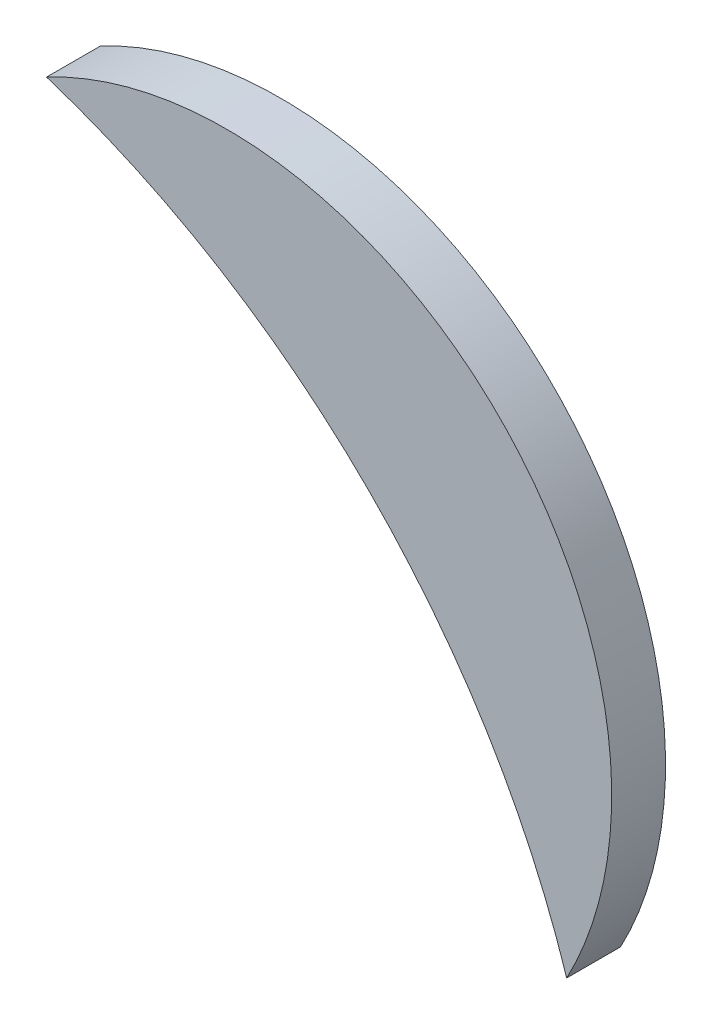
ISO-10303-21;
HEADER;
FILE_DESCRIPTION(('STEP AP214'),'2;1');
FILE_NAME('part.step','',(''),(''),'','','');
FILE_SCHEMA(('AUTOMOTIVE_DESIGN { 1 0 10303 214 1 1 1 1 }'));
ENDSEC;
DATA;
#1=APPLICATION_CONTEXT('core data for automotive mechanical design processes');
#2=APPLICATION_PROTOCOL_DEFINITION('international standard','automotive_design',2000,#1);
#3=PRODUCT_CONTEXT('',#1,'mechanical');
#4=PRODUCT('Part','Part','',(#3));
#5=PRODUCT_RELATED_PRODUCT_CATEGORY('part','',(#4));
#6=PRODUCT_DEFINITION_FORMATION('','',#4);
#7=PRODUCT_DEFINITION_CONTEXT('part definition',#1,'design');
#8=PRODUCT_DEFINITION('design','',#6,#7);
#9=PRODUCT_DEFINITION_SHAPE('','',#8);
#10=(LENGTH_UNIT() NAMED_UNIT(*) SI_UNIT(.MILLI.,.METRE.));
#11=(NAMED_UNIT(*) PLANE_ANGLE_UNIT() SI_UNIT($,.RADIAN.));
#12=(NAMED_UNIT(*) SI_UNIT($,.STERADIAN.) SOLID_ANGLE_UNIT());
#13=UNCERTAINTY_MEASURE_WITH_UNIT(LENGTH_MEASURE(1.E-05),#10,'distance_accuracy_value','');
#14=(GEOMETRIC_REPRESENTATION_CONTEXT(3) GLOBAL_UNCERTAINTY_ASSIGNED_CONTEXT((#13)) GLOBAL_UNIT_ASSIGNED_CONTEXT((#10,
#11,#12)) REPRESENTATION_CONTEXT('',''));
#15=CARTESIAN_POINT('',(0.,0.,0.));
#16=DIRECTION('',(0.,0.,1.));
#17=DIRECTION('',(1.,0.,0.));
#18=AXIS2_PLACEMENT_3D('',#15,#16,#17);
#19=CARTESIAN_POINT('',(139.628776,-111.910776,0.));
#20=DIRECTION('',(0.,0.,1.));
#21=DIRECTION('',(1.,0.,0.));
#22=AXIS2_PLACEMENT_3D('',#19,#20,#21);
#23=PLANE('',#22);
#24=CARTESIAN_POINT('',(139.452,-111.734,0.));
#25=DIRECTION('',(0.,0.,-1.));
#26=DIRECTION('',(0.,-1.,0.));
#27=AXIS2_PLACEMENT_3D('',#24,#25,#26);
#28=CIRCLE('',#27,0.525);
#29=CARTESIAN_POINT('',(139.61346385155,-111.234445774,0.));
#30=VERTEX_POINT('',#29);
#31=CARTESIAN_POINT('',(139.95155364678,-111.5725343566,0.));
#32=VERTEX_POINT('',#31);
#33=EDGE_CURVE('E11',#30,#32,#28,.T.);
#34=ORIENTED_EDGE('',*,*,#33,.T.);
#35=CARTESIAN_POINT('',(139.7307995,-111.4551995,0.));
#36=DIRECTION('',(0.,0.,1.));
#37=DIRECTION('',(0.707106781186548,-0.707106781186548,0.));
#38=AXIS2_PLACEMENT_3D('',#35,#36,#37);
#39=CIRCLE('',#38,0.249999723809);
#40=EDGE_CURVE('E57',#32,#30,#39,.T.);
#41=ORIENTED_EDGE('',*,*,#40,.T.);
#42=EDGE_LOOP('',(#34,#41));
#43=FACE_BOUND('',#42,.T.);
#44=ADVANCED_FACE('F17',(#43),#23,.T.);
#45=CARTESIAN_POINT('',(139.452,-111.734,-0.045));
#46=DIRECTION('',(0.,0.,-1.));
#47=DIRECTION('',(0.,-1.,0.));
#48=AXIS2_PLACEMENT_3D('',#45,#46,#47);
#49=CYLINDRICAL_SURFACE('',#48,0.525);
#50=DIRECTION('',(0.,0.,-1.));
#51=VECTOR('',#50,1.);
#52=CARTESIAN_POINT('',(139.95155364678,-111.5725343566,-0.035));
#53=LINE('',#52,#51);
#54=CARTESIAN_POINT('',(139.95155364678,-111.5725343566,-0.035));
#55=VERTEX_POINT('',#54);
#56=EDGE_CURVE('E55',#32,#55,#53,.T.);
#57=ORIENTED_EDGE('',*,*,#56,.F.);
#58=ORIENTED_EDGE('',*,*,#33,.F.);
#59=DIRECTION('',(0.,0.,-1.));
#60=VECTOR('',#59,1.);
#61=CARTESIAN_POINT('',(139.61346385156,-111.234445774,-0.035));
#62=LINE('',#61,#60);
#63=CARTESIAN_POINT('',(139.61346385155,-111.234445774,-0.035));
#64=VERTEX_POINT('',#63);
#65=EDGE_CURVE('E53',#30,#64,#62,.T.);
#66=ORIENTED_EDGE('',*,*,#65,.T.);
#67=CARTESIAN_POINT('',(139.452,-111.734,-0.035));
#68=DIRECTION('',(0.,0.,-1.));
#69=DIRECTION('',(0.,-1.,0.));
#70=AXIS2_PLACEMENT_3D('',#67,#68,#69);
#71=CIRCLE('',#70,0.525);
#72=EDGE_CURVE('E20',#64,#55,#71,.T.);
#73=ORIENTED_EDGE('',*,*,#72,.T.);
#74=EDGE_LOOP('',(#57,#58,#66,#73));
#75=FACE_BOUND('',#74,.T.);
#76=ADVANCED_FACE('F51',(#75),#49,.F.);
#77=CARTESIAN_POINT('',(139.628776,-111.910776,-0.035));
#78=DIRECTION('',(0.,0.,1.));
#79=DIRECTION('',(1.,0.,0.));
#80=AXIS2_PLACEMENT_3D('',#77,#78,#79);
#81=PLANE('',#80);
#82=CARTESIAN_POINT('',(139.7307995,-111.4551995,-0.035));
#83=DIRECTION('',(0.,0.,1.));
#84=DIRECTION('',(0.707106781186548,-0.707106781186548,0.));
#85=AXIS2_PLACEMENT_3D('',#82,#83,#84);
#86=CIRCLE('',#85,0.249999723809);
#87=EDGE_CURVE('E63',#55,#64,#86,.T.);
#88=ORIENTED_EDGE('',*,*,#87,.F.);
#89=ORIENTED_EDGE('',*,*,#72,.F.);
#90=EDGE_LOOP('',(#88,#89));
#91=FACE_BOUND('',#90,.T.);
#92=ADVANCED_FACE('F95',(#91),#81,.F.);
#93=CARTESIAN_POINT('',(139.7307995,-111.4551995,-0.035));
#94=DIRECTION('',(0.,0.,-1.));
#95=DIRECTION('',(0.707106781186548,-0.707106781186548,0.));
#96=AXIS2_PLACEMENT_3D('',#93,#94,#95);
#97=CYLINDRICAL_SURFACE('',#96,0.249999723809);
#98=ORIENTED_EDGE('',*,*,#65,.F.);
#99=ORIENTED_EDGE('',*,*,#40,.F.);
#100=ORIENTED_EDGE('',*,*,#56,.T.);
#101=ORIENTED_EDGE('',*,*,#87,.T.);
#102=EDGE_LOOP('',(#98,#99,#100,#101));
#103=FACE_BOUND('',#102,.T.);
#104=ADVANCED_FACE('F62',(#103),#97,.T.);
#105=CLOSED_SHELL('',(#44,#76,#92,#104));
#106=MANIFOLD_SOLID_BREP('B1',#105);
#107=ADVANCED_BREP_SHAPE_REPRESENTATION('',(#18,#106),#14);
#108=SHAPE_DEFINITION_REPRESENTATION(#9,#107);
ENDSEC;
END-ISO-10303-21;
